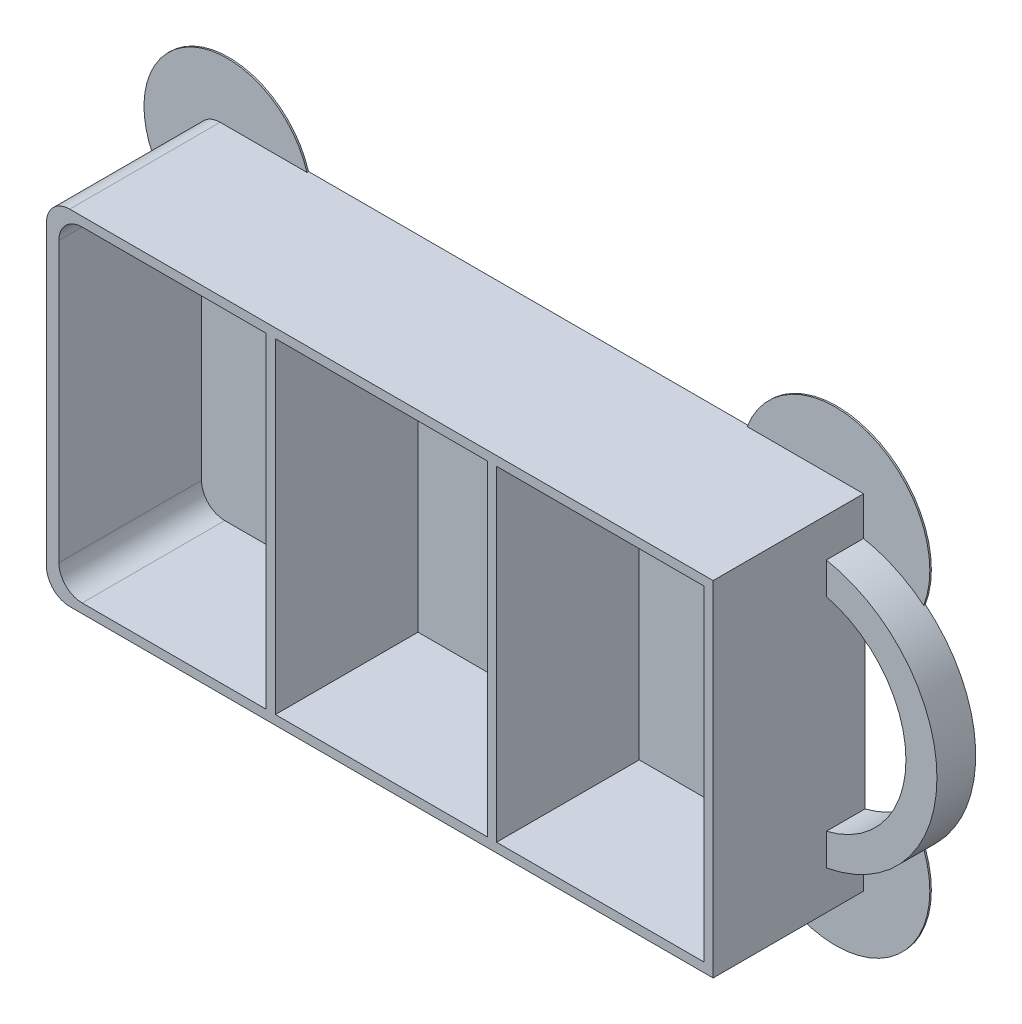
ISO-10303-21;
HEADER;
FILE_DESCRIPTION(('STEP AP214'),'2;1');
FILE_NAME('part.step','',(''),(''),'','','');
FILE_SCHEMA(('AUTOMOTIVE_DESIGN { 1 0 10303 214 1 1 1 1 }'));
ENDSEC;
DATA;
#1=APPLICATION_CONTEXT('core data for automotive mechanical design processes');
#2=APPLICATION_PROTOCOL_DEFINITION('international standard','automotive_design',2000,#1);
#3=PRODUCT_CONTEXT('',#1,'mechanical');
#4=PRODUCT('Part','Part','',(#3));
#5=PRODUCT_RELATED_PRODUCT_CATEGORY('part','',(#4));
#6=PRODUCT_DEFINITION_FORMATION('','',#4);
#7=PRODUCT_DEFINITION_CONTEXT('part definition',#1,'design');
#8=PRODUCT_DEFINITION('design','',#6,#7);
#9=PRODUCT_DEFINITION_SHAPE('','',#8);
#10=(LENGTH_UNIT() NAMED_UNIT(*) SI_UNIT(.MILLI.,.METRE.));
#11=(NAMED_UNIT(*) PLANE_ANGLE_UNIT() SI_UNIT($,.RADIAN.));
#12=(NAMED_UNIT(*) SI_UNIT($,.STERADIAN.) SOLID_ANGLE_UNIT());
#13=UNCERTAINTY_MEASURE_WITH_UNIT(LENGTH_MEASURE(1.E-05),#10,'distance_accuracy_value','');
#14=(GEOMETRIC_REPRESENTATION_CONTEXT(3) GLOBAL_UNCERTAINTY_ASSIGNED_CONTEXT((#13)) GLOBAL_UNIT_ASSIGNED_CONTEXT((#10,
#11,#12)) REPRESENTATION_CONTEXT('',''));
#15=CARTESIAN_POINT('',(0.,0.,0.));
#16=DIRECTION('',(0.,0.,1.));
#17=DIRECTION('',(1.,0.,0.));
#18=AXIS2_PLACEMENT_3D('',#15,#16,#17);
#19=CARTESIAN_POINT('',(-40.,-19.2,19.6));
#20=DIRECTION('',(0.,0.,-1.));
#21=DIRECTION('',(-1.,0.,0.));
#22=AXIS2_PLACEMENT_3D('',#19,#20,#21);
#23=CYLINDRICAL_SURFACE('',#22,3.);
#24=DIRECTION('',(0.,0.,-1.));
#25=VECTOR('',#24,1.);
#26=CARTESIAN_POINT('',(-43.,-19.2,19.6));
#27=LINE('',#26,#25);
#28=CARTESIAN_POINT('',(-43.,-19.2,0.199999999999999));
#29=VERTEX_POINT('',#28);
#30=CARTESIAN_POINT('',(-43.,-19.2,19.6));
#31=VERTEX_POINT('',#30);
#32=EDGE_CURVE('E289',#29,#31,#27,.F.);
#33=ORIENTED_EDGE('',*,*,#32,.F.);
#34=CARTESIAN_POINT('',(-40.,-19.2,0.199999999999999));
#35=DIRECTION('',(0.,0.,-1.));
#36=DIRECTION('',(-1.,0.,0.));
#37=AXIS2_PLACEMENT_3D('',#34,#35,#36);
#38=CIRCLE('',#37,3.);
#39=CARTESIAN_POINT('',(-40.,-22.2,0.199999999999999));
#40=VERTEX_POINT('',#39);
#41=EDGE_CURVE('E12',#29,#40,#38,.F.);
#42=ORIENTED_EDGE('',*,*,#41,.T.);
#43=DIRECTION('',(0.,0.,-1.));
#44=VECTOR('',#43,1.);
#45=CARTESIAN_POINT('',(-40.,-22.2,19.6));
#46=LINE('',#45,#44);
#47=CARTESIAN_POINT('',(-40.,-22.2,19.6));
#48=VERTEX_POINT('',#47);
#49=EDGE_CURVE('E300',#48,#40,#46,.T.);
#50=ORIENTED_EDGE('',*,*,#49,.F.);
#51=CARTESIAN_POINT('',(-40.,-19.2,19.6));
#52=DIRECTION('',(0.,0.,1.));
#53=DIRECTION('',(1.,0.,0.));
#54=AXIS2_PLACEMENT_3D('',#51,#52,#53);
#55=CIRCLE('',#54,3.);
#56=EDGE_CURVE('E296',#31,#48,#55,.T.);
#57=ORIENTED_EDGE('',*,*,#56,.F.);
#58=EDGE_LOOP('',(#33,#42,#50,#57));
#59=FACE_BOUND('',#58,.T.);
#60=ADVANCED_FACE('F41',(#59),#23,.T.);
#61=CARTESIAN_POINT('',(43.,22.2,19.6));
#62=DIRECTION('',(-1.,0.,0.));
#63=DIRECTION('',(0.,-1.,0.));
#64=AXIS2_PLACEMENT_3D('',#61,#62,#63);
#65=PLANE('',#64);
#66=DIRECTION('',(0.,0.,-1.));
#67=VECTOR('',#66,1.);
#68=CARTESIAN_POINT('',(43.,-22.2,19.6));
#69=LINE('',#68,#67);
#70=CARTESIAN_POINT('',(43.,-22.2,19.6));
#71=VERTEX_POINT('',#70);
#72=CARTESIAN_POINT('',(43.,-22.2,0.199999999999999));
#73=VERTEX_POINT('',#72);
#74=EDGE_CURVE('E283',#71,#73,#69,.T.);
#75=ORIENTED_EDGE('',*,*,#74,.T.);
#76=DIRECTION('',(0.,1.,0.));
#77=VECTOR('',#76,1.);
#78=CARTESIAN_POINT('',(43.,22.2,0.199999999999999));
#79=LINE('',#78,#77);
#80=CARTESIAN_POINT('',(43.,-17.2,0.2));
#81=VERTEX_POINT('',#80);
#82=EDGE_CURVE('E380',#73,#81,#79,.T.);
#83=ORIENTED_EDGE('',*,*,#82,.T.);
#84=DIRECTION('',(0.,0.,-1.));
#85=VECTOR('',#84,1.);
#86=CARTESIAN_POINT('',(43.,-17.2,5.));
#87=LINE('',#86,#85);
#88=CARTESIAN_POINT('',(43.,-17.2,5.));
#89=VERTEX_POINT('',#88);
#90=EDGE_CURVE('E490',#89,#81,#87,.T.);
#91=ORIENTED_EDGE('',*,*,#90,.F.);
#92=DIRECTION('',(0.,-1.,0.));
#93=VECTOR('',#92,1.);
#94=CARTESIAN_POINT('',(43.,-17.2,5.));
#95=LINE('',#94,#93);
#96=CARTESIAN_POINT('',(43.,-13.1087756865391,5.));
#97=VERTEX_POINT('',#96);
#98=EDGE_CURVE('E487',#97,#89,#95,.T.);
#99=ORIENTED_EDGE('',*,*,#98,.F.);
#100=DIRECTION('',(0.,0.,-1.));
#101=VECTOR('',#100,1.);
#102=CARTESIAN_POINT('',(43.,-13.1087756865391,5.));
#103=LINE('',#102,#101);
#104=CARTESIAN_POINT('',(43.,-13.1087756865391,0.));
#105=VERTEX_POINT('',#104);
#106=EDGE_CURVE('E496',#97,#105,#103,.T.);
#107=ORIENTED_EDGE('',*,*,#106,.T.);
#108=DIRECTION('',(0.,1.,0.));
#109=VECTOR('',#108,1.);
#110=CARTESIAN_POINT('',(43.,22.2,0.));
#111=LINE('',#110,#109);
#112=CARTESIAN_POINT('',(43.,13.1087756865391,0.));
#113=VERTEX_POINT('',#112);
#114=EDGE_CURVE('E361',#105,#113,#111,.T.);
#115=ORIENTED_EDGE('',*,*,#114,.T.);
#116=DIRECTION('',(0.,0.,-1.));
#117=VECTOR('',#116,1.);
#118=CARTESIAN_POINT('',(43.,13.1087756865391,5.));
#119=LINE('',#118,#117);
#120=CARTESIAN_POINT('',(43.,13.1087756865391,5.));
#121=VERTEX_POINT('',#120);
#122=EDGE_CURVE('E499',#121,#113,#119,.T.);
#123=ORIENTED_EDGE('',*,*,#122,.F.);
#124=DIRECTION('',(0.,-1.,0.));
#125=VECTOR('',#124,1.);
#126=CARTESIAN_POINT('',(43.,17.2,5.));
#127=LINE('',#126,#125);
#128=CARTESIAN_POINT('',(43.,17.2,5.));
#129=VERTEX_POINT('',#128);
#130=EDGE_CURVE('E480',#129,#121,#127,.T.);
#131=ORIENTED_EDGE('',*,*,#130,.F.);
#132=DIRECTION('',(0.,0.,-1.));
#133=VECTOR('',#132,1.);
#134=CARTESIAN_POINT('',(43.,17.2,5.));
#135=LINE('',#134,#133);
#136=CARTESIAN_POINT('',(43.,17.2,0.2));
#137=VERTEX_POINT('',#136);
#138=EDGE_CURVE('E362',#129,#137,#135,.T.);
#139=ORIENTED_EDGE('',*,*,#138,.T.);
#140=DIRECTION('',(0.,-1.,0.));
#141=VECTOR('',#140,1.);
#142=CARTESIAN_POINT('',(43.,22.2,0.199999999999999));
#143=LINE('',#142,#141);
#144=CARTESIAN_POINT('',(43.,22.2,0.199999999999999));
#145=VERTEX_POINT('',#144);
#146=EDGE_CURVE('E384',#145,#137,#143,.T.);
#147=ORIENTED_EDGE('',*,*,#146,.F.);
#148=DIRECTION('',(0.,0.,-1.));
#149=VECTOR('',#148,1.);
#150=CARTESIAN_POINT('',(43.,22.2,19.6));
#151=LINE('',#150,#149);
#152=CARTESIAN_POINT('',(43.,22.2,19.6));
#153=VERTEX_POINT('',#152);
#154=EDGE_CURVE('E285',#153,#145,#151,.T.);
#155=ORIENTED_EDGE('',*,*,#154,.F.);
#156=DIRECTION('',(0.,1.,0.));
#157=VECTOR('',#156,1.);
#158=CARTESIAN_POINT('',(43.,22.2,19.6));
#159=LINE('',#158,#157);
#160=EDGE_CURVE('E273',#71,#153,#159,.T.);
#161=ORIENTED_EDGE('',*,*,#160,.F.);
#162=EDGE_LOOP('',(#75,#83,#91,#99,#107,#115,#123,#131,#139,#147,#155,#161));
#163=FACE_BOUND('',#162,.T.);
#164=ADVANCED_FACE('F505',(#163),#65,.F.);
#165=CARTESIAN_POINT('',(0.,0.,19.6));
#166=DIRECTION('',(0.,0.,1.));
#167=DIRECTION('',(1.,0.,0.));
#168=AXIS2_PLACEMENT_3D('',#165,#166,#167);
#169=PLANE('',#168);
#170=DIRECTION('',(-1.,0.,0.));
#171=VECTOR('',#170,1.);
#172=CARTESIAN_POINT('',(0.,21.,19.6));
#173=LINE('',#172,#171);
#174=CARTESIAN_POINT('',(-14.6666666666667,21.,19.6));
#175=VERTEX_POINT('',#174);
#176=CARTESIAN_POINT('',(-38.4,21.,19.6));
#177=VERTEX_POINT('',#176);
#178=EDGE_CURVE('E401',#175,#177,#173,.T.);
#179=ORIENTED_EDGE('',*,*,#178,.F.);
#180=DIRECTION('',(0.,1.,0.));
#181=VECTOR('',#180,1.);
#182=CARTESIAN_POINT('',(-14.6666666666667,0.,19.6));
#183=LINE('',#182,#181);
#184=CARTESIAN_POINT('',(-14.6666666666667,-21.,19.6));
#185=VERTEX_POINT('',#184);
#186=EDGE_CURVE('E410',#185,#175,#183,.T.);
#187=ORIENTED_EDGE('',*,*,#186,.F.);
#188=DIRECTION('',(1.,0.,0.));
#189=VECTOR('',#188,1.);
#190=CARTESIAN_POINT('',(0.,-21.,19.6));
#191=LINE('',#190,#189);
#192=CARTESIAN_POINT('',(-38.4,-21.,19.6));
#193=VERTEX_POINT('',#192);
#194=EDGE_CURVE('E408',#193,#185,#191,.T.);
#195=ORIENTED_EDGE('',*,*,#194,.F.);
#196=CARTESIAN_POINT('',(-38.4,-18.,19.6));
#197=DIRECTION('',(0.,0.,1.));
#198=DIRECTION('',(1.,0.,0.));
#199=AXIS2_PLACEMENT_3D('',#196,#197,#198);
#200=CIRCLE('',#199,3.);
#201=CARTESIAN_POINT('',(-41.4,-18.,19.6));
#202=VERTEX_POINT('',#201);
#203=EDGE_CURVE('E316',#193,#202,#200,.F.);
#204=ORIENTED_EDGE('',*,*,#203,.T.);
#205=DIRECTION('',(0.,-1.,0.));
#206=VECTOR('',#205,1.);
#207=CARTESIAN_POINT('',(-41.4,0.,19.6));
#208=LINE('',#207,#206);
#209=CARTESIAN_POINT('',(-41.4,18.,19.6));
#210=VERTEX_POINT('',#209);
#211=EDGE_CURVE('E404',#210,#202,#208,.T.);
#212=ORIENTED_EDGE('',*,*,#211,.F.);
#213=CARTESIAN_POINT('',(-38.4,18.,19.6));
#214=DIRECTION('',(0.,0.,1.));
#215=DIRECTION('',(1.,0.,0.));
#216=AXIS2_PLACEMENT_3D('',#213,#214,#215);
#217=CIRCLE('',#216,3.);
#218=EDGE_CURVE('E318',#210,#177,#217,.F.);
#219=ORIENTED_EDGE('',*,*,#218,.T.);
#220=EDGE_LOOP('',(#179,#187,#195,#204,#212,#219));
#221=FACE_BOUND('',#220,.T.);
#222=DIRECTION('',(-1.,0.,0.));
#223=VECTOR('',#222,1.);
#224=CARTESIAN_POINT('',(0.,21.,19.6));
#225=LINE('',#224,#223);
#226=CARTESIAN_POINT('',(41.8,21.,19.6));
#227=VERTEX_POINT('',#226);
#228=CARTESIAN_POINT('',(15.0666666666667,21.,19.6));
#229=VERTEX_POINT('',#228);
#230=EDGE_CURVE('E391',#227,#229,#225,.T.);
#231=ORIENTED_EDGE('',*,*,#230,.F.);
#232=DIRECTION('',(0.,1.,0.));
#233=VECTOR('',#232,1.);
#234=CARTESIAN_POINT('',(41.8,0.,19.6));
#235=LINE('',#234,#233);
#236=CARTESIAN_POINT('',(41.8,-21.,19.6));
#237=VERTEX_POINT('',#236);
#238=EDGE_CURVE('E465',#237,#227,#235,.T.);
#239=ORIENTED_EDGE('',*,*,#238,.F.);
#240=DIRECTION('',(1.,0.,0.));
#241=VECTOR('',#240,1.);
#242=CARTESIAN_POINT('',(0.,-21.,19.6));
#243=LINE('',#242,#241);
#244=CARTESIAN_POINT('',(15.0666666666667,-21.,19.6));
#245=VERTEX_POINT('',#244);
#246=EDGE_CURVE('E462',#245,#237,#243,.T.);
#247=ORIENTED_EDGE('',*,*,#246,.F.);
#248=DIRECTION('',(0.,-1.,0.));
#249=VECTOR('',#248,1.);
#250=CARTESIAN_POINT('',(15.0666666666667,0.,19.6));
#251=LINE('',#250,#249);
#252=EDGE_CURVE('E459',#229,#245,#251,.T.);
#253=ORIENTED_EDGE('',*,*,#252,.F.);
#254=EDGE_LOOP('',(#231,#239,#247,#253));
#255=FACE_BOUND('',#254,.T.);
#256=DIRECTION('',(-1.,0.,0.));
#257=VECTOR('',#256,1.);
#258=CARTESIAN_POINT('',(-43.,22.2,19.6));
#259=LINE('',#258,#257);
#260=CARTESIAN_POINT('',(-40.,22.2,19.6));
#261=VERTEX_POINT('',#260);
#262=EDGE_CURVE('E277',#153,#261,#259,.T.);
#263=ORIENTED_EDGE('',*,*,#262,.T.);
#264=CARTESIAN_POINT('',(-40.,19.2,19.6));
#265=DIRECTION('',(0.,0.,1.));
#266=DIRECTION('',(1.,0.,0.));
#267=AXIS2_PLACEMENT_3D('',#264,#265,#266);
#268=CIRCLE('',#267,3.);
#269=CARTESIAN_POINT('',(-43.,19.2,19.6));
#270=VERTEX_POINT('',#269);
#271=EDGE_CURVE('E298',#261,#270,#268,.T.);
#272=ORIENTED_EDGE('',*,*,#271,.T.);
#273=DIRECTION('',(0.,-1.,0.));
#274=VECTOR('',#273,1.);
#275=CARTESIAN_POINT('',(-43.,22.2,19.6));
#276=LINE('',#275,#274);
#277=EDGE_CURVE('E351',#270,#31,#276,.T.);
#278=ORIENTED_EDGE('',*,*,#277,.T.);
#279=ORIENTED_EDGE('',*,*,#56,.T.);
#280=DIRECTION('',(1.,0.,0.));
#281=VECTOR('',#280,1.);
#282=CARTESIAN_POINT('',(-43.,-22.2,19.6));
#283=LINE('',#282,#281);
#284=EDGE_CURVE('E286',#48,#71,#283,.T.);
#285=ORIENTED_EDGE('',*,*,#284,.T.);
#286=ORIENTED_EDGE('',*,*,#160,.T.);
#287=EDGE_LOOP('',(#263,#272,#278,#279,#285,#286));
#288=FACE_BOUND('',#287,.T.);
#289=DIRECTION('',(-1.,0.,0.));
#290=VECTOR('',#289,1.);
#291=CARTESIAN_POINT('',(0.,21.,19.6));
#292=LINE('',#291,#290);
#293=CARTESIAN_POINT('',(13.8666666666667,21.,19.6));
#294=VERTEX_POINT('',#293);
#295=CARTESIAN_POINT('',(-13.4666666666667,21.,19.6));
#296=VERTEX_POINT('',#295);
#297=EDGE_CURVE('E432',#294,#296,#292,.T.);
#298=ORIENTED_EDGE('',*,*,#297,.F.);
#299=DIRECTION('',(0.,-1.,0.));
#300=VECTOR('',#299,1.);
#301=CARTESIAN_POINT('',(13.8666666666667,0.,19.6));
#302=LINE('',#301,#300);
#303=CARTESIAN_POINT('',(13.8666666666667,-21.,19.6));
#304=VERTEX_POINT('',#303);
#305=EDGE_CURVE('E429',#294,#304,#302,.T.);
#306=ORIENTED_EDGE('',*,*,#305,.T.);
#307=DIRECTION('',(1.,0.,0.));
#308=VECTOR('',#307,1.);
#309=CARTESIAN_POINT('',(0.,-21.,19.6));
#310=LINE('',#309,#308);
#311=CARTESIAN_POINT('',(-13.4666666666667,-21.,19.6));
#312=VERTEX_POINT('',#311);
#313=EDGE_CURVE('E439',#312,#304,#310,.T.);
#314=ORIENTED_EDGE('',*,*,#313,.F.);
#315=DIRECTION('',(0.,1.,0.));
#316=VECTOR('',#315,1.);
#317=CARTESIAN_POINT('',(-13.4666666666667,0.,19.6));
#318=LINE('',#317,#316);
#319=EDGE_CURVE('E436',#312,#296,#318,.T.);
#320=ORIENTED_EDGE('',*,*,#319,.T.);
#321=EDGE_LOOP('',(#298,#306,#314,#320));
#322=FACE_BOUND('',#321,.T.);
#323=ADVANCED_FACE('F349',(#221,#255,#288,#322),#169,.T.);
#324=CARTESIAN_POINT('',(-43.,22.2,19.6));
#325=DIRECTION('',(0.,-1.,0.));
#326=DIRECTION('',(0.,0.,-1.));
#327=AXIS2_PLACEMENT_3D('',#324,#325,#326);
#328=PLANE('',#327);
#329=DIRECTION('',(-1.,0.,0.));
#330=VECTOR('',#329,1.);
#331=CARTESIAN_POINT('',(-43.,22.2,0.));
#332=LINE('',#331,#330);
#333=CARTESIAN_POINT('',(27.9898071749444,22.2,0.));
#334=VERTEX_POINT('',#333);
#335=CARTESIAN_POINT('',(-28.7935026442278,22.2,0.));
#336=VERTEX_POINT('',#335);
#337=EDGE_CURVE('E279',#334,#336,#332,.T.);
#338=ORIENTED_EDGE('',*,*,#337,.T.);
#339=DIRECTION('',(0.,0.,-1.));
#340=VECTOR('',#339,1.);
#341=CARTESIAN_POINT('',(-28.7935026442278,22.2,0.2));
#342=LINE('',#341,#340);
#343=CARTESIAN_POINT('',(-28.7935026442278,22.2,0.2));
#344=VERTEX_POINT('',#343);
#345=EDGE_CURVE('E341',#344,#336,#342,.T.);
#346=ORIENTED_EDGE('',*,*,#345,.F.);
#347=DIRECTION('',(-1.,0.,0.));
#348=VECTOR('',#347,1.);
#349=CARTESIAN_POINT('',(-43.,22.2,0.199999999999999));
#350=LINE('',#349,#348);
#351=CARTESIAN_POINT('',(-40.,22.2,0.199999999999999));
#352=VERTEX_POINT('',#351);
#353=EDGE_CURVE('E329',#344,#352,#350,.T.);
#354=ORIENTED_EDGE('',*,*,#353,.T.);
#355=DIRECTION('',(0.,0.,-1.));
#356=VECTOR('',#355,1.);
#357=CARTESIAN_POINT('',(-40.,22.2,19.6));
#358=LINE('',#357,#356);
#359=EDGE_CURVE('E294',#352,#261,#358,.F.);
#360=ORIENTED_EDGE('',*,*,#359,.T.);
#361=ORIENTED_EDGE('',*,*,#262,.F.);
#362=ORIENTED_EDGE('',*,*,#154,.T.);
#363=DIRECTION('',(1.,0.,0.));
#364=VECTOR('',#363,1.);
#365=CARTESIAN_POINT('',(-43.,22.2,0.199999999999999));
#366=LINE('',#365,#364);
#367=CARTESIAN_POINT('',(27.9898071749445,22.2,0.199999999999999));
#368=VERTEX_POINT('',#367);
#369=EDGE_CURVE('E388',#368,#145,#366,.T.);
#370=ORIENTED_EDGE('',*,*,#369,.F.);
#371=DIRECTION('',(0.,0.,-1.));
#372=VECTOR('',#371,1.);
#373=CARTESIAN_POINT('',(27.9898071749445,22.2,0.2));
#374=LINE('',#373,#372);
#375=EDGE_CURVE('E365',#368,#334,#374,.T.);
#376=ORIENTED_EDGE('',*,*,#375,.T.);
#377=EDGE_LOOP('',(#338,#346,#354,#360,#361,#362,#370,#376));
#378=FACE_BOUND('',#377,.T.);
#379=ADVANCED_FACE('F339',(#378),#328,.F.);
#380=CARTESIAN_POINT('',(-43.,22.2,19.6));
#381=DIRECTION('',(1.,0.,0.));
#382=DIRECTION('',(0.,1.,0.));
#383=AXIS2_PLACEMENT_3D('',#380,#381,#382);
#384=PLANE('',#383);
#385=DIRECTION('',(0.,-1.,0.));
#386=VECTOR('',#385,1.);
#387=CARTESIAN_POINT('',(-43.,22.2,0.));
#388=LINE('',#387,#386);
#389=CARTESIAN_POINT('',(-43.,9.06873174434304,0.));
#390=VERTEX_POINT('',#389);
#391=CARTESIAN_POINT('',(-43.,-9.06873174434304,0.));
#392=VERTEX_POINT('',#391);
#393=EDGE_CURVE('E274',#390,#392,#388,.T.);
#394=ORIENTED_EDGE('',*,*,#393,.T.);
#395=DIRECTION('',(0.,0.,-1.));
#396=VECTOR('',#395,1.);
#397=CARTESIAN_POINT('',(-43.,-9.06873174434304,0.2));
#398=LINE('',#397,#396);
#399=CARTESIAN_POINT('',(-43.,-9.06873174434304,0.2));
#400=VERTEX_POINT('',#399);
#401=EDGE_CURVE('E255',#400,#392,#398,.T.);
#402=ORIENTED_EDGE('',*,*,#401,.F.);
#403=DIRECTION('',(0.,1.,0.));
#404=VECTOR('',#403,1.);
#405=CARTESIAN_POINT('',(-43.,22.2,0.199999999999999));
#406=LINE('',#405,#404);
#407=EDGE_CURVE('E518',#29,#400,#406,.T.);
#408=ORIENTED_EDGE('',*,*,#407,.F.);
#409=ORIENTED_EDGE('',*,*,#32,.T.);
#410=ORIENTED_EDGE('',*,*,#277,.F.);
#411=DIRECTION('',(0.,0.,-1.));
#412=VECTOR('',#411,1.);
#413=CARTESIAN_POINT('',(-43.,19.2,19.6));
#414=LINE('',#413,#412);
#415=CARTESIAN_POINT('',(-43.,19.2,0.199999999999999));
#416=VERTEX_POINT('',#415);
#417=EDGE_CURVE('E291',#270,#416,#414,.T.);
#418=ORIENTED_EDGE('',*,*,#417,.T.);
#419=DIRECTION('',(0.,-1.,0.));
#420=VECTOR('',#419,1.);
#421=CARTESIAN_POINT('',(-43.,22.2,0.199999999999999));
#422=LINE('',#421,#420);
#423=CARTESIAN_POINT('',(-43.,9.06873174434304,0.2));
#424=VERTEX_POINT('',#423);
#425=EDGE_CURVE('E332',#416,#424,#422,.T.);
#426=ORIENTED_EDGE('',*,*,#425,.T.);
#427=DIRECTION('',(0.,0.,-1.));
#428=VECTOR('',#427,1.);
#429=CARTESIAN_POINT('',(-43.,9.06873174434304,0.2));
#430=LINE('',#429,#428);
#431=EDGE_CURVE('E519',#424,#390,#430,.T.);
#432=ORIENTED_EDGE('',*,*,#431,.T.);
#433=EDGE_LOOP('',(#394,#402,#408,#409,#410,#418,#426,#432));
#434=FACE_BOUND('',#433,.T.);
#435=ADVANCED_FACE('F354',(#434),#384,.F.);
#436=CARTESIAN_POINT('',(-43.,-22.2,19.6));
#437=DIRECTION('',(0.,1.,0.));
#438=DIRECTION('',(0.,0.,1.));
#439=AXIS2_PLACEMENT_3D('',#436,#437,#438);
#440=PLANE('',#439);
#441=DIRECTION('',(-1.,0.,0.));
#442=VECTOR('',#441,1.);
#443=CARTESIAN_POINT('',(-43.,-22.2,0.199999999999999));
#444=LINE('',#443,#442);
#445=CARTESIAN_POINT('',(-28.7935026442278,-22.2,0.2));
#446=VERTEX_POINT('',#445);
#447=EDGE_CURVE('E260',#446,#40,#444,.T.);
#448=ORIENTED_EDGE('',*,*,#447,.F.);
#449=DIRECTION('',(0.,0.,-1.));
#450=VECTOR('',#449,1.);
#451=CARTESIAN_POINT('',(-28.7935026442278,-22.2,0.2));
#452=LINE('',#451,#450);
#453=CARTESIAN_POINT('',(-28.7935026442278,-22.2,0.));
#454=VERTEX_POINT('',#453);
#455=EDGE_CURVE('E252',#446,#454,#452,.T.);
#456=ORIENTED_EDGE('',*,*,#455,.T.);
#457=DIRECTION('',(1.,0.,0.));
#458=VECTOR('',#457,1.);
#459=CARTESIAN_POINT('',(-43.,-22.2,0.));
#460=LINE('',#459,#458);
#461=CARTESIAN_POINT('',(27.9898071749444,-22.2,0.));
#462=VERTEX_POINT('',#461);
#463=EDGE_CURVE('E265',#454,#462,#460,.T.);
#464=ORIENTED_EDGE('',*,*,#463,.T.);
#465=DIRECTION('',(0.,0.,-1.));
#466=VECTOR('',#465,1.);
#467=CARTESIAN_POINT('',(27.9898071749445,-22.2,0.2));
#468=LINE('',#467,#466);
#469=CARTESIAN_POINT('',(27.9898071749445,-22.2,0.199999999999999));
#470=VERTEX_POINT('',#469);
#471=EDGE_CURVE('E56',#470,#462,#468,.T.);
#472=ORIENTED_EDGE('',*,*,#471,.F.);
#473=DIRECTION('',(1.,0.,0.));
#474=VECTOR('',#473,1.);
#475=CARTESIAN_POINT('',(-43.,-22.2,0.199999999999999));
#476=LINE('',#475,#474);
#477=EDGE_CURVE('E60',#470,#73,#476,.T.);
#478=ORIENTED_EDGE('',*,*,#477,.T.);
#479=ORIENTED_EDGE('',*,*,#74,.F.);
#480=ORIENTED_EDGE('',*,*,#284,.F.);
#481=ORIENTED_EDGE('',*,*,#49,.T.);
#482=EDGE_LOOP('',(#448,#456,#464,#472,#478,#479,#480,#481));
#483=FACE_BOUND('',#482,.T.);
#484=ADVANCED_FACE('F264',(#483),#440,.F.);
#485=CARTESIAN_POINT('',(0.,0.,0.));
#486=DIRECTION('',(0.,0.,1.));
#487=DIRECTION('',(1.,0.,0.));
#488=AXIS2_PLACEMENT_3D('',#485,#486,#487);
#489=PLANE('',#488);
#490=CARTESIAN_POINT('',(-39.0748386955667,-19.0726849277525,0.));
#491=DIRECTION('',(0.,0.,-1.));
#492=DIRECTION('',(-1.,0.,0.));
#493=AXIS2_PLACEMENT_3D('',#490,#491,#492);
#494=CIRCLE('',#493,10.7464399017381);
#495=EDGE_CURVE('E248',#454,#392,#494,.T.);
#496=ORIENTED_EDGE('',*,*,#495,.T.);
#497=ORIENTED_EDGE('',*,*,#393,.F.);
#498=CARTESIAN_POINT('',(-39.0748386955667,19.0726849277525,0.));
#499=DIRECTION('',(0.,0.,-1.));
#500=DIRECTION('',(1.,0.,0.));
#501=AXIS2_PLACEMENT_3D('',#498,#499,#500);
#502=CIRCLE('',#501,10.7464399017381);
#503=EDGE_CURVE('E370',#390,#336,#502,.T.);
#504=ORIENTED_EDGE('',*,*,#503,.T.);
#505=ORIENTED_EDGE('',*,*,#337,.F.);
#506=CARTESIAN_POINT('',(39.3809279660677,17.9059340937888,0.));
#507=DIRECTION('',(0.,0.,-1.));
#508=DIRECTION('',(-1.,0.,0.));
#509=AXIS2_PLACEMENT_3D('',#506,#507,#508);
#510=CIRCLE('',#509,12.173604022016);
#511=CARTESIAN_POINT('',(50.7720487571908,13.6118681875776,0.));
#512=VERTEX_POINT('',#511);
#513=EDGE_CURVE('E369',#334,#512,#510,.T.);
#514=ORIENTED_EDGE('',*,*,#513,.T.);
#515=CARTESIAN_POINT('',(39.7735468390197,0.,0.));
#516=DIRECTION('',(0.,0.,1.));
#517=DIRECTION('',(1.,0.,0.));
#518=AXIS2_PLACEMENT_3D('',#515,#516,#517);
#519=CIRCLE('',#518,17.5);
#520=CARTESIAN_POINT('',(50.7720487571908,-13.6118681875775,0.));
#521=VERTEX_POINT('',#520);
#522=EDGE_CURVE('E419',#521,#512,#519,.T.);
#523=ORIENTED_EDGE('',*,*,#522,.F.);
#524=CARTESIAN_POINT('',(39.3809279660677,-17.9059340937888,0.));
#525=DIRECTION('',(0.,0.,-1.));
#526=DIRECTION('',(1.,0.,0.));
#527=AXIS2_PLACEMENT_3D('',#524,#525,#526);
#528=CIRCLE('',#527,12.173604022016);
#529=EDGE_CURVE('E272',#521,#462,#528,.T.);
#530=ORIENTED_EDGE('',*,*,#529,.T.);
#531=ORIENTED_EDGE('',*,*,#463,.F.);
#532=EDGE_LOOP('',(#496,#497,#504,#505,#514,#523,#530,#531));
#533=FACE_BOUND('',#532,.T.);
#534=CARTESIAN_POINT('',(39.7735468390197,0.,0.));
#535=DIRECTION('',(0.,0.,-1.));
#536=DIRECTION('',(1.,0.,0.));
#537=AXIS2_PLACEMENT_3D('',#534,#535,#536);
#538=CIRCLE('',#537,13.5);
#539=EDGE_CURVE('E481',#113,#105,#538,.T.);
#540=ORIENTED_EDGE('',*,*,#539,.F.);
#541=ORIENTED_EDGE('',*,*,#114,.F.);
#542=EDGE_LOOP('',(#540,#541));
#543=FACE_BOUND('',#542,.T.);
#544=ADVANCED_FACE('F269',(#533,#543),#489,.F.);
#545=CARTESIAN_POINT('',(39.7735468390197,0.,5.));
#546=DIRECTION('',(0.,0.,-1.));
#547=DIRECTION('',(-1.,0.,0.));
#548=AXIS2_PLACEMENT_3D('',#545,#546,#547);
#549=CYLINDRICAL_SURFACE('',#548,17.5);
#550=CARTESIAN_POINT('',(39.7735468390197,0.,0.2));
#551=DIRECTION('',(0.,0.,1.));
#552=DIRECTION('',(1.,0.,0.));
#553=AXIS2_PLACEMENT_3D('',#550,#551,#552);
#554=CIRCLE('',#553,17.5);
#555=CARTESIAN_POINT('',(50.7720487571908,-13.6118681875776,0.2));
#556=VERTEX_POINT('',#555);
#557=EDGE_CURVE('E323',#81,#556,#554,.T.);
#558=ORIENTED_EDGE('',*,*,#557,.T.);
#559=DIRECTION('',(0.,0.,-1.));
#560=VECTOR('',#559,1.);
#561=CARTESIAN_POINT('',(50.7720487571908,-13.6118681875775,0.2));
#562=LINE('',#561,#560);
#563=EDGE_CURVE('E342',#556,#521,#562,.T.);
#564=ORIENTED_EDGE('',*,*,#563,.T.);
#565=ORIENTED_EDGE('',*,*,#522,.T.);
#566=DIRECTION('',(0.,0.,-1.));
#567=VECTOR('',#566,1.);
#568=CARTESIAN_POINT('',(50.7720487571908,13.6118681875775,0.2));
#569=LINE('',#568,#567);
#570=CARTESIAN_POINT('',(50.7720487571908,13.6118681875776,0.2));
#571=VERTEX_POINT('',#570);
#572=EDGE_CURVE('E376',#571,#512,#569,.T.);
#573=ORIENTED_EDGE('',*,*,#572,.F.);
#574=CARTESIAN_POINT('',(39.7735468390197,0.,0.2));
#575=DIRECTION('',(0.,0.,-1.));
#576=DIRECTION('',(-1.,0.,0.));
#577=AXIS2_PLACEMENT_3D('',#574,#575,#576);
#578=CIRCLE('',#577,17.5);
#579=EDGE_CURVE('E320',#137,#571,#578,.T.);
#580=ORIENTED_EDGE('',*,*,#579,.F.);
#581=ORIENTED_EDGE('',*,*,#138,.F.);
#582=CARTESIAN_POINT('',(39.7735468390197,0.,5.));
#583=DIRECTION('',(0.,0.,1.));
#584=DIRECTION('',(1.,0.,0.));
#585=AXIS2_PLACEMENT_3D('',#582,#583,#584);
#586=CIRCLE('',#585,17.5);
#587=EDGE_CURVE('E477',#89,#129,#586,.T.);
#588=ORIENTED_EDGE('',*,*,#587,.F.);
#589=ORIENTED_EDGE('',*,*,#90,.T.);
#590=EDGE_LOOP('',(#558,#564,#565,#573,#580,#581,#588,#589));
#591=FACE_BOUND('',#590,.T.);
#592=ADVANCED_FACE('F540',(#591),#549,.T.);
#593=CARTESIAN_POINT('',(39.7735468390197,0.,5.));
#594=DIRECTION('',(0.,0.,-1.));
#595=DIRECTION('',(-1.,0.,0.));
#596=AXIS2_PLACEMENT_3D('',#593,#594,#595);
#597=CYLINDRICAL_SURFACE('',#596,13.5);
#598=ORIENTED_EDGE('',*,*,#539,.T.);
#599=ORIENTED_EDGE('',*,*,#106,.F.);
#600=CARTESIAN_POINT('',(39.7735468390197,0.,5.));
#601=DIRECTION('',(0.,0.,-1.));
#602=DIRECTION('',(1.,0.,0.));
#603=AXIS2_PLACEMENT_3D('',#600,#601,#602);
#604=CIRCLE('',#603,13.5);
#605=EDGE_CURVE('E484',#121,#97,#604,.T.);
#606=ORIENTED_EDGE('',*,*,#605,.F.);
#607=ORIENTED_EDGE('',*,*,#122,.T.);
#608=EDGE_LOOP('',(#598,#599,#606,#607));
#609=FACE_BOUND('',#608,.T.);
#610=ADVANCED_FACE('F655',(#609),#597,.F.);
#611=CARTESIAN_POINT('',(39.7735468390197,0.,5.));
#612=DIRECTION('',(0.,0.,1.));
#613=DIRECTION('',(1.,0.,0.));
#614=AXIS2_PLACEMENT_3D('',#611,#612,#613);
#615=PLANE('',#614);
#616=ORIENTED_EDGE('',*,*,#587,.T.);
#617=ORIENTED_EDGE('',*,*,#130,.T.);
#618=ORIENTED_EDGE('',*,*,#605,.T.);
#619=ORIENTED_EDGE('',*,*,#98,.T.);
#620=EDGE_LOOP('',(#616,#617,#618,#619));
#621=FACE_BOUND('',#620,.T.);
#622=ADVANCED_FACE('F651',(#621),#615,.T.);
#623=CARTESIAN_POINT('',(0.,21.,-50.1109879279097));
#624=DIRECTION('',(0.,1.,0.));
#625=DIRECTION('',(0.,0.,1.));
#626=AXIS2_PLACEMENT_3D('',#623,#624,#625);
#627=PLANE('',#626);
#628=DIRECTION('',(1.,0.,0.));
#629=VECTOR('',#628,1.);
#630=CARTESIAN_POINT('',(0.,21.,1.2));
#631=LINE('',#630,#629);
#632=CARTESIAN_POINT('',(15.0666666666667,21.,1.2));
#633=VERTEX_POINT('',#632);
#634=CARTESIAN_POINT('',(41.8,21.,1.2));
#635=VERTEX_POINT('',#634);
#636=EDGE_CURVE('E456',#633,#635,#631,.T.);
#637=ORIENTED_EDGE('',*,*,#636,.T.);
#638=DIRECTION('',(0.,0.,1.));
#639=VECTOR('',#638,1.);
#640=CARTESIAN_POINT('',(41.8,21.,-50.1109879279097));
#641=LINE('',#640,#639);
#642=EDGE_CURVE('E454',#635,#227,#641,.T.);
#643=ORIENTED_EDGE('',*,*,#642,.T.);
#644=ORIENTED_EDGE('',*,*,#230,.T.);
#645=DIRECTION('',(0.,0.,1.));
#646=VECTOR('',#645,1.);
#647=CARTESIAN_POINT('',(15.0666666666667,21.,-50.1109879279097));
#648=LINE('',#647,#646);
#649=EDGE_CURVE('E468',#633,#229,#648,.T.);
#650=ORIENTED_EDGE('',*,*,#649,.F.);
#651=EDGE_LOOP('',(#637,#643,#644,#650));
#652=FACE_BOUND('',#651,.T.);
#653=ADVANCED_FACE('F641',(#652),#627,.F.);
#654=CARTESIAN_POINT('',(41.8,0.,-50.1109879279097));
#655=DIRECTION('',(1.,0.,0.));
#656=DIRECTION('',(0.,1.,0.));
#657=AXIS2_PLACEMENT_3D('',#654,#655,#656);
#658=PLANE('',#657);
#659=DIRECTION('',(0.,-1.,0.));
#660=VECTOR('',#659,1.);
#661=CARTESIAN_POINT('',(41.8,0.,1.2));
#662=LINE('',#661,#660);
#663=CARTESIAN_POINT('',(41.8,-21.,1.2));
#664=VERTEX_POINT('',#663);
#665=EDGE_CURVE('E453',#635,#664,#662,.T.);
#666=ORIENTED_EDGE('',*,*,#665,.T.);
#667=DIRECTION('',(0.,0.,1.));
#668=VECTOR('',#667,1.);
#669=CARTESIAN_POINT('',(41.8,-21.,-50.1109879279097));
#670=LINE('',#669,#668);
#671=EDGE_CURVE('E470',#664,#237,#670,.T.);
#672=ORIENTED_EDGE('',*,*,#671,.T.);
#673=ORIENTED_EDGE('',*,*,#238,.T.);
#674=ORIENTED_EDGE('',*,*,#642,.F.);
#675=EDGE_LOOP('',(#666,#672,#673,#674));
#676=FACE_BOUND('',#675,.T.);
#677=ADVANCED_FACE('F637',(#676),#658,.F.);
#678=CARTESIAN_POINT('',(0.,-21.,-50.1109879279097));
#679=DIRECTION('',(0.,-1.,0.));
#680=DIRECTION('',(0.,0.,-1.));
#681=AXIS2_PLACEMENT_3D('',#678,#679,#680);
#682=PLANE('',#681);
#683=DIRECTION('',(-1.,0.,0.));
#684=VECTOR('',#683,1.);
#685=CARTESIAN_POINT('',(0.,-21.,1.2));
#686=LINE('',#685,#684);
#687=CARTESIAN_POINT('',(15.0666666666667,-21.,1.2));
#688=VERTEX_POINT('',#687);
#689=EDGE_CURVE('E451',#664,#688,#686,.T.);
#690=ORIENTED_EDGE('',*,*,#689,.T.);
#691=DIRECTION('',(0.,0.,1.));
#692=VECTOR('',#691,1.);
#693=CARTESIAN_POINT('',(15.0666666666667,-21.,-50.1109879279097));
#694=LINE('',#693,#692);
#695=EDGE_CURVE('E472',#688,#245,#694,.T.);
#696=ORIENTED_EDGE('',*,*,#695,.T.);
#697=ORIENTED_EDGE('',*,*,#246,.T.);
#698=ORIENTED_EDGE('',*,*,#671,.F.);
#699=EDGE_LOOP('',(#690,#696,#697,#698));
#700=FACE_BOUND('',#699,.T.);
#701=ADVANCED_FACE('F640',(#700),#682,.F.);
#702=CARTESIAN_POINT('',(15.0666666666667,0.,-50.1109879279097));
#703=DIRECTION('',(-1.,0.,0.));
#704=DIRECTION('',(0.,0.,1.));
#705=AXIS2_PLACEMENT_3D('',#702,#703,#704);
#706=PLANE('',#705);
#707=DIRECTION('',(0.,1.,0.));
#708=VECTOR('',#707,1.);
#709=CARTESIAN_POINT('',(15.0666666666667,0.,1.2));
#710=LINE('',#709,#708);
#711=EDGE_CURVE('E433',#688,#633,#710,.T.);
#712=ORIENTED_EDGE('',*,*,#711,.T.);
#713=ORIENTED_EDGE('',*,*,#649,.T.);
#714=ORIENTED_EDGE('',*,*,#252,.T.);
#715=ORIENTED_EDGE('',*,*,#695,.F.);
#716=EDGE_LOOP('',(#712,#713,#714,#715));
#717=FACE_BOUND('',#716,.T.);
#718=ADVANCED_FACE('F635',(#717),#706,.F.);
#719=CARTESIAN_POINT('',(0.,0.,1.2));
#720=DIRECTION('',(0.,0.,1.));
#721=DIRECTION('',(1.,0.,0.));
#722=AXIS2_PLACEMENT_3D('',#719,#720,#721);
#723=PLANE('',#722);
#724=ORIENTED_EDGE('',*,*,#636,.F.);
#725=ORIENTED_EDGE('',*,*,#711,.F.);
#726=ORIENTED_EDGE('',*,*,#689,.F.);
#727=ORIENTED_EDGE('',*,*,#665,.F.);
#728=EDGE_LOOP('',(#724,#725,#726,#727));
#729=FACE_BOUND('',#728,.T.);
#730=ADVANCED_FACE('F631',(#729),#723,.T.);
#731=CARTESIAN_POINT('',(13.8666666666667,0.,-50.1109879279097));
#732=DIRECTION('',(-1.,0.,0.));
#733=DIRECTION('',(0.,0.,1.));
#734=AXIS2_PLACEMENT_3D('',#731,#732,#733);
#735=PLANE('',#734);
#736=DIRECTION('',(0.,0.,1.));
#737=VECTOR('',#736,1.);
#738=CARTESIAN_POINT('',(13.8666666666667,-21.,-50.1109879279097));
#739=LINE('',#738,#737);
#740=CARTESIAN_POINT('',(13.8666666666667,-21.,1.2));
#741=VERTEX_POINT('',#740);
#742=EDGE_CURVE('E424',#741,#304,#739,.T.);
#743=ORIENTED_EDGE('',*,*,#742,.T.);
#744=ORIENTED_EDGE('',*,*,#305,.F.);
#745=DIRECTION('',(0.,0.,1.));
#746=VECTOR('',#745,1.);
#747=CARTESIAN_POINT('',(13.8666666666667,21.,-50.1109879279097));
#748=LINE('',#747,#746);
#749=CARTESIAN_POINT('',(13.8666666666667,21.,1.2));
#750=VERTEX_POINT('',#749);
#751=EDGE_CURVE('E442',#750,#294,#748,.T.);
#752=ORIENTED_EDGE('',*,*,#751,.F.);
#753=DIRECTION('',(0.,1.,0.));
#754=VECTOR('',#753,1.);
#755=CARTESIAN_POINT('',(13.8666666666667,0.,1.2));
#756=LINE('',#755,#754);
#757=EDGE_CURVE('E426',#741,#750,#756,.T.);
#758=ORIENTED_EDGE('',*,*,#757,.F.);
#759=EDGE_LOOP('',(#743,#744,#752,#758));
#760=FACE_BOUND('',#759,.T.);
#761=ADVANCED_FACE('F621',(#760),#735,.T.);
#762=CARTESIAN_POINT('',(0.,-21.,-50.1109879279097));
#763=DIRECTION('',(0.,-1.,0.));
#764=DIRECTION('',(0.,0.,-1.));
#765=AXIS2_PLACEMENT_3D('',#762,#763,#764);
#766=PLANE('',#765);
#767=DIRECTION('',(-1.,0.,0.));
#768=VECTOR('',#767,1.);
#769=CARTESIAN_POINT('',(0.,-21.,1.2));
#770=LINE('',#769,#768);
#771=CARTESIAN_POINT('',(-13.4666666666667,-21.,1.2));
#772=VERTEX_POINT('',#771);
#773=EDGE_CURVE('E423',#741,#772,#770,.T.);
#774=ORIENTED_EDGE('',*,*,#773,.T.);
#775=DIRECTION('',(0.,0.,1.));
#776=VECTOR('',#775,1.);
#777=CARTESIAN_POINT('',(-13.4666666666667,-21.,-50.1109879279097));
#778=LINE('',#777,#776);
#779=EDGE_CURVE('E444',#772,#312,#778,.T.);
#780=ORIENTED_EDGE('',*,*,#779,.T.);
#781=ORIENTED_EDGE('',*,*,#313,.T.);
#782=ORIENTED_EDGE('',*,*,#742,.F.);
#783=EDGE_LOOP('',(#774,#780,#781,#782));
#784=FACE_BOUND('',#783,.T.);
#785=ADVANCED_FACE('F617',(#784),#766,.F.);
#786=CARTESIAN_POINT('',(-13.4666666666667,0.,-50.1109879279097));
#787=DIRECTION('',(1.,0.,0.));
#788=DIRECTION('',(0.,0.,-1.));
#789=AXIS2_PLACEMENT_3D('',#786,#787,#788);
#790=PLANE('',#789);
#791=DIRECTION('',(0.,0.,1.));
#792=VECTOR('',#791,1.);
#793=CARTESIAN_POINT('',(-13.4666666666667,21.,-50.1109879279097));
#794=LINE('',#793,#792);
#795=CARTESIAN_POINT('',(-13.4666666666667,21.,1.2));
#796=VERTEX_POINT('',#795);
#797=EDGE_CURVE('E446',#796,#296,#794,.T.);
#798=ORIENTED_EDGE('',*,*,#797,.T.);
#799=ORIENTED_EDGE('',*,*,#319,.F.);
#800=ORIENTED_EDGE('',*,*,#779,.F.);
#801=DIRECTION('',(0.,-1.,0.));
#802=VECTOR('',#801,1.);
#803=CARTESIAN_POINT('',(-13.4666666666667,0.,1.2));
#804=LINE('',#803,#802);
#805=EDGE_CURVE('E420',#796,#772,#804,.T.);
#806=ORIENTED_EDGE('',*,*,#805,.F.);
#807=EDGE_LOOP('',(#798,#799,#800,#806));
#808=FACE_BOUND('',#807,.T.);
#809=ADVANCED_FACE('F620',(#808),#790,.T.);
#810=CARTESIAN_POINT('',(0.,21.,-50.1109879279097));
#811=DIRECTION('',(0.,1.,0.));
#812=DIRECTION('',(0.,0.,1.));
#813=AXIS2_PLACEMENT_3D('',#810,#811,#812);
#814=PLANE('',#813);
#815=DIRECTION('',(1.,0.,0.));
#816=VECTOR('',#815,1.);
#817=CARTESIAN_POINT('',(0.,21.,1.2));
#818=LINE('',#817,#816);
#819=EDGE_CURVE('E405',#796,#750,#818,.T.);
#820=ORIENTED_EDGE('',*,*,#819,.T.);
#821=ORIENTED_EDGE('',*,*,#751,.T.);
#822=ORIENTED_EDGE('',*,*,#297,.T.);
#823=ORIENTED_EDGE('',*,*,#797,.F.);
#824=EDGE_LOOP('',(#820,#821,#822,#823));
#825=FACE_BOUND('',#824,.T.);
#826=ADVANCED_FACE('F615',(#825),#814,.F.);
#827=CARTESIAN_POINT('',(0.,0.,1.2));
#828=DIRECTION('',(0.,0.,1.));
#829=DIRECTION('',(1.,0.,0.));
#830=AXIS2_PLACEMENT_3D('',#827,#828,#829);
#831=PLANE('',#830);
#832=ORIENTED_EDGE('',*,*,#773,.F.);
#833=ORIENTED_EDGE('',*,*,#757,.T.);
#834=ORIENTED_EDGE('',*,*,#819,.F.);
#835=ORIENTED_EDGE('',*,*,#805,.T.);
#836=EDGE_LOOP('',(#832,#833,#834,#835));
#837=FACE_BOUND('',#836,.T.);
#838=ADVANCED_FACE('F612',(#837),#831,.T.);
#839=CARTESIAN_POINT('',(0.,21.,-50.1109879279097));
#840=DIRECTION('',(0.,1.,0.));
#841=DIRECTION('',(0.,0.,1.));
#842=AXIS2_PLACEMENT_3D('',#839,#840,#841);
#843=PLANE('',#842);
#844=ORIENTED_EDGE('',*,*,#178,.T.);
#845=DIRECTION('',(0.,0.,1.));
#846=VECTOR('',#845,1.);
#847=CARTESIAN_POINT('',(-38.4,21.,1.2));
#848=LINE('',#847,#846);
#849=CARTESIAN_POINT('',(-38.4,21.,1.2));
#850=VERTEX_POINT('',#849);
#851=EDGE_CURVE('E314',#177,#850,#848,.F.);
#852=ORIENTED_EDGE('',*,*,#851,.T.);
#853=DIRECTION('',(1.,0.,0.));
#854=VECTOR('',#853,1.);
#855=CARTESIAN_POINT('',(0.,21.,1.2));
#856=LINE('',#855,#854);
#857=CARTESIAN_POINT('',(-14.6666666666667,21.,1.2));
#858=VERTEX_POINT('',#857);
#859=EDGE_CURVE('E398',#850,#858,#856,.T.);
#860=ORIENTED_EDGE('',*,*,#859,.T.);
#861=DIRECTION('',(0.,0.,1.));
#862=VECTOR('',#861,1.);
#863=CARTESIAN_POINT('',(-14.6666666666667,21.,-50.1109879279097));
#864=LINE('',#863,#862);
#865=EDGE_CURVE('E396',#858,#175,#864,.T.);
#866=ORIENTED_EDGE('',*,*,#865,.T.);
#867=EDGE_LOOP('',(#844,#852,#860,#866));
#868=FACE_BOUND('',#867,.T.);
#869=ADVANCED_FACE('F594',(#868),#843,.F.);
#870=CARTESIAN_POINT('',(-14.6666666666667,0.,-50.1109879279097));
#871=DIRECTION('',(1.,0.,0.));
#872=DIRECTION('',(0.,0.,-1.));
#873=AXIS2_PLACEMENT_3D('',#870,#871,#872);
#874=PLANE('',#873);
#875=DIRECTION('',(0.,-1.,0.));
#876=VECTOR('',#875,1.);
#877=CARTESIAN_POINT('',(-14.6666666666667,0.,1.2));
#878=LINE('',#877,#876);
#879=CARTESIAN_POINT('',(-14.6666666666667,-21.,1.2));
#880=VERTEX_POINT('',#879);
#881=EDGE_CURVE('E395',#858,#880,#878,.T.);
#882=ORIENTED_EDGE('',*,*,#881,.T.);
#883=DIRECTION('',(0.,0.,1.));
#884=VECTOR('',#883,1.);
#885=CARTESIAN_POINT('',(-14.6666666666667,-21.,-50.1109879279097));
#886=LINE('',#885,#884);
#887=EDGE_CURVE('E413',#880,#185,#886,.T.);
#888=ORIENTED_EDGE('',*,*,#887,.T.);
#889=ORIENTED_EDGE('',*,*,#186,.T.);
#890=ORIENTED_EDGE('',*,*,#865,.F.);
#891=EDGE_LOOP('',(#882,#888,#889,#890));
#892=FACE_BOUND('',#891,.T.);
#893=ADVANCED_FACE('F586',(#892),#874,.F.);
#894=CARTESIAN_POINT('',(0.,-21.,-50.1109879279097));
#895=DIRECTION('',(0.,-1.,0.));
#896=DIRECTION('',(0.,0.,-1.));
#897=AXIS2_PLACEMENT_3D('',#894,#895,#896);
#898=PLANE('',#897);
#899=DIRECTION('',(-1.,0.,0.));
#900=VECTOR('',#899,1.);
#901=CARTESIAN_POINT('',(0.,-21.,1.2));
#902=LINE('',#901,#900);
#903=CARTESIAN_POINT('',(-38.4,-21.,1.2));
#904=VERTEX_POINT('',#903);
#905=EDGE_CURVE('E392',#880,#904,#902,.T.);
#906=ORIENTED_EDGE('',*,*,#905,.T.);
#907=DIRECTION('',(0.,0.,1.));
#908=VECTOR('',#907,1.);
#909=CARTESIAN_POINT('',(-38.4,-21.,19.6));
#910=LINE('',#909,#908);
#911=EDGE_CURVE('E302',#904,#193,#910,.T.);
#912=ORIENTED_EDGE('',*,*,#911,.T.);
#913=ORIENTED_EDGE('',*,*,#194,.T.);
#914=ORIENTED_EDGE('',*,*,#887,.F.);
#915=EDGE_LOOP('',(#906,#912,#913,#914));
#916=FACE_BOUND('',#915,.T.);
#917=ADVANCED_FACE('F582',(#916),#898,.F.);
#918=CARTESIAN_POINT('',(-41.4,0.,-50.1109879279097));
#919=DIRECTION('',(-1.,0.,0.));
#920=DIRECTION('',(0.,-1.,0.));
#921=AXIS2_PLACEMENT_3D('',#918,#919,#920);
#922=PLANE('',#921);
#923=ORIENTED_EDGE('',*,*,#211,.T.);
#924=DIRECTION('',(0.,0.,1.));
#925=VECTOR('',#924,1.);
#926=CARTESIAN_POINT('',(-41.4,-18.,1.2));
#927=LINE('',#926,#925);
#928=CARTESIAN_POINT('',(-41.4,-18.,1.2));
#929=VERTEX_POINT('',#928);
#930=EDGE_CURVE('E308',#202,#929,#927,.F.);
#931=ORIENTED_EDGE('',*,*,#930,.T.);
#932=DIRECTION('',(0.,1.,0.));
#933=VECTOR('',#932,1.);
#934=CARTESIAN_POINT('',(-41.4,0.,1.2));
#935=LINE('',#934,#933);
#936=CARTESIAN_POINT('',(-41.4,18.,1.2));
#937=VERTEX_POINT('',#936);
#938=EDGE_CURVE('E400',#929,#937,#935,.T.);
#939=ORIENTED_EDGE('',*,*,#938,.T.);
#940=DIRECTION('',(0.,0.,1.));
#941=VECTOR('',#940,1.);
#942=CARTESIAN_POINT('',(-41.4,18.,19.6));
#943=LINE('',#942,#941);
#944=EDGE_CURVE('E305',#937,#210,#943,.T.);
#945=ORIENTED_EDGE('',*,*,#944,.T.);
#946=EDGE_LOOP('',(#923,#931,#939,#945));
#947=FACE_BOUND('',#946,.T.);
#948=ADVANCED_FACE('F599',(#947),#922,.F.);
#949=CARTESIAN_POINT('',(0.,0.,1.2));
#950=DIRECTION('',(0.,0.,1.));
#951=DIRECTION('',(1.,0.,0.));
#952=AXIS2_PLACEMENT_3D('',#949,#950,#951);
#953=PLANE('',#952);
#954=ORIENTED_EDGE('',*,*,#938,.F.);
#955=CARTESIAN_POINT('',(-38.4,-18.,1.2));
#956=DIRECTION('',(0.,0.,1.));
#957=DIRECTION('',(1.,0.,0.));
#958=AXIS2_PLACEMENT_3D('',#955,#956,#957);
#959=CIRCLE('',#958,3.);
#960=EDGE_CURVE('E312',#929,#904,#959,.T.);
#961=ORIENTED_EDGE('',*,*,#960,.T.);
#962=ORIENTED_EDGE('',*,*,#905,.F.);
#963=ORIENTED_EDGE('',*,*,#881,.F.);
#964=ORIENTED_EDGE('',*,*,#859,.F.);
#965=CARTESIAN_POINT('',(-38.4,18.,1.2));
#966=DIRECTION('',(0.,0.,1.));
#967=DIRECTION('',(1.,0.,0.));
#968=AXIS2_PLACEMENT_3D('',#965,#966,#967);
#969=CIRCLE('',#968,3.);
#970=EDGE_CURVE('E310',#850,#937,#969,.T.);
#971=ORIENTED_EDGE('',*,*,#970,.T.);
#972=EDGE_LOOP('',(#954,#961,#962,#963,#964,#971));
#973=FACE_BOUND('',#972,.T.);
#974=ADVANCED_FACE('F572',(#973),#953,.T.);
#975=CARTESIAN_POINT('',(-40.,19.2,19.6));
#976=DIRECTION('',(0.,0.,-1.));
#977=DIRECTION('',(-1.,0.,0.));
#978=AXIS2_PLACEMENT_3D('',#975,#976,#977);
#979=CYLINDRICAL_SURFACE('',#978,3.);
#980=CARTESIAN_POINT('',(-40.,19.2,0.199999999999999));
#981=DIRECTION('',(0.,0.,1.));
#982=DIRECTION('',(1.,0.,0.));
#983=AXIS2_PLACEMENT_3D('',#980,#981,#982);
#984=CIRCLE('',#983,3.);
#985=EDGE_CURVE('E49',#416,#352,#984,.F.);
#986=ORIENTED_EDGE('',*,*,#985,.F.);
#987=ORIENTED_EDGE('',*,*,#417,.F.);
#988=ORIENTED_EDGE('',*,*,#271,.F.);
#989=ORIENTED_EDGE('',*,*,#359,.F.);
#990=EDGE_LOOP('',(#986,#987,#988,#989));
#991=FACE_BOUND('',#990,.T.);
#992=ADVANCED_FACE('F345',(#991),#979,.T.);
#993=CARTESIAN_POINT('',(-38.4,-18.,-50.1109879279097));
#994=DIRECTION('',(0.,0.,-1.));
#995=DIRECTION('',(-1.,0.,0.));
#996=AXIS2_PLACEMENT_3D('',#993,#994,#995);
#997=CYLINDRICAL_SURFACE('',#996,3.);
#998=ORIENTED_EDGE('',*,*,#960,.F.);
#999=ORIENTED_EDGE('',*,*,#930,.F.);
#1000=ORIENTED_EDGE('',*,*,#203,.F.);
#1001=ORIENTED_EDGE('',*,*,#911,.F.);
#1002=EDGE_LOOP('',(#998,#999,#1000,#1001));
#1003=FACE_BOUND('',#1002,.T.);
#1004=ADVANCED_FACE('F563',(#1003),#997,.F.);
#1005=CARTESIAN_POINT('',(-38.4,18.,-50.1109879279097));
#1006=DIRECTION('',(0.,0.,-1.));
#1007=DIRECTION('',(-1.,0.,0.));
#1008=AXIS2_PLACEMENT_3D('',#1005,#1006,#1007);
#1009=CYLINDRICAL_SURFACE('',#1008,3.);
#1010=ORIENTED_EDGE('',*,*,#970,.F.);
#1011=ORIENTED_EDGE('',*,*,#851,.F.);
#1012=ORIENTED_EDGE('',*,*,#218,.F.);
#1013=ORIENTED_EDGE('',*,*,#944,.F.);
#1014=EDGE_LOOP('',(#1010,#1011,#1012,#1013));
#1015=FACE_BOUND('',#1014,.T.);
#1016=ADVANCED_FACE('F43',(#1015),#1009,.F.);
#1017=CARTESIAN_POINT('',(39.3809279660677,17.9059340937888,0.2));
#1018=DIRECTION('',(0.,0.,-1.));
#1019=DIRECTION('',(-1.,0.,0.));
#1020=AXIS2_PLACEMENT_3D('',#1017,#1018,#1019);
#1021=CYLINDRICAL_SURFACE('',#1020,12.173604022016);
#1022=ORIENTED_EDGE('',*,*,#513,.F.);
#1023=ORIENTED_EDGE('',*,*,#375,.F.);
#1024=CARTESIAN_POINT('',(39.3809279660677,17.9059340937888,0.2));
#1025=DIRECTION('',(0.,0.,-1.));
#1026=DIRECTION('',(-1.,0.,0.));
#1027=AXIS2_PLACEMENT_3D('',#1024,#1025,#1026);
#1028=CIRCLE('',#1027,12.173604022016);
#1029=EDGE_CURVE('E377',#368,#571,#1028,.T.);
#1030=ORIENTED_EDGE('',*,*,#1029,.T.);
#1031=ORIENTED_EDGE('',*,*,#572,.T.);
#1032=EDGE_LOOP('',(#1022,#1023,#1030,#1031));
#1033=FACE_BOUND('',#1032,.T.);
#1034=ADVANCED_FACE('F373',(#1033),#1021,.T.);
#1035=CARTESIAN_POINT('',(39.3809279660677,17.9059340937888,0.2));
#1036=DIRECTION('',(0.,0.,-1.));
#1037=DIRECTION('',(-1.,0.,0.));
#1038=AXIS2_PLACEMENT_3D('',#1035,#1036,#1037);
#1039=PLANE('',#1038);
#1040=ORIENTED_EDGE('',*,*,#1029,.F.);
#1041=ORIENTED_EDGE('',*,*,#369,.T.);
#1042=ORIENTED_EDGE('',*,*,#146,.T.);
#1043=ORIENTED_EDGE('',*,*,#579,.T.);
#1044=EDGE_LOOP('',(#1040,#1041,#1042,#1043));
#1045=FACE_BOUND('',#1044,.T.);
#1046=ADVANCED_FACE('F510',(#1045),#1039,.F.);
#1047=CARTESIAN_POINT('',(39.3809279660677,-17.9059340937888,0.2));
#1048=DIRECTION('',(0.,0.,-1.));
#1049=DIRECTION('',(-1.,0.,0.));
#1050=AXIS2_PLACEMENT_3D('',#1047,#1048,#1049);
#1051=CYLINDRICAL_SURFACE('',#1050,12.173604022016);
#1052=ORIENTED_EDGE('',*,*,#529,.F.);
#1053=ORIENTED_EDGE('',*,*,#563,.F.);
#1054=CARTESIAN_POINT('',(39.3809279660677,-17.9059340937888,0.2));
#1055=DIRECTION('',(0.,0.,-1.));
#1056=DIRECTION('',(1.,0.,0.));
#1057=AXIS2_PLACEMENT_3D('',#1054,#1055,#1056);
#1058=CIRCLE('',#1057,12.173604022016);
#1059=EDGE_CURVE('E532',#556,#470,#1058,.T.);
#1060=ORIENTED_EDGE('',*,*,#1059,.T.);
#1061=ORIENTED_EDGE('',*,*,#471,.T.);
#1062=EDGE_LOOP('',(#1052,#1053,#1060,#1061));
#1063=FACE_BOUND('',#1062,.T.);
#1064=ADVANCED_FACE('F545',(#1063),#1051,.T.);
#1065=CARTESIAN_POINT('',(39.3809279660677,-17.9059340937888,0.2));
#1066=DIRECTION('',(0.,0.,1.));
#1067=DIRECTION('',(1.,0.,0.));
#1068=AXIS2_PLACEMENT_3D('',#1065,#1066,#1067);
#1069=PLANE('',#1068);
#1070=ORIENTED_EDGE('',*,*,#477,.F.);
#1071=ORIENTED_EDGE('',*,*,#1059,.F.);
#1072=ORIENTED_EDGE('',*,*,#557,.F.);
#1073=ORIENTED_EDGE('',*,*,#82,.F.);
#1074=EDGE_LOOP('',(#1070,#1071,#1072,#1073));
#1075=FACE_BOUND('',#1074,.T.);
#1076=ADVANCED_FACE('F543',(#1075),#1069,.T.);
#1077=CARTESIAN_POINT('',(-39.0748386955667,19.0726849277525,0.2));
#1078=DIRECTION('',(0.,0.,1.));
#1079=DIRECTION('',(1.,0.,0.));
#1080=AXIS2_PLACEMENT_3D('',#1077,#1078,#1079);
#1081=PLANE('',#1080);
#1082=ORIENTED_EDGE('',*,*,#353,.F.);
#1083=CARTESIAN_POINT('',(-39.0748386955667,19.0726849277525,0.2));
#1084=DIRECTION('',(0.,0.,-1.));
#1085=DIRECTION('',(1.,0.,0.));
#1086=AXIS2_PLACEMENT_3D('',#1083,#1084,#1085);
#1087=CIRCLE('',#1086,10.7464399017381);
#1088=EDGE_CURVE('E526',#424,#344,#1087,.T.);
#1089=ORIENTED_EDGE('',*,*,#1088,.F.);
#1090=ORIENTED_EDGE('',*,*,#425,.F.);
#1091=ORIENTED_EDGE('',*,*,#985,.T.);
#1092=EDGE_LOOP('',(#1082,#1089,#1090,#1091));
#1093=FACE_BOUND('',#1092,.T.);
#1094=ADVANCED_FACE('F327',(#1093),#1081,.T.);
#1095=CARTESIAN_POINT('',(-39.0748386955667,19.0726849277525,0.2));
#1096=DIRECTION('',(0.,0.,-1.));
#1097=DIRECTION('',(-1.,0.,0.));
#1098=AXIS2_PLACEMENT_3D('',#1095,#1096,#1097);
#1099=CYLINDRICAL_SURFACE('',#1098,10.7464399017381);
#1100=ORIENTED_EDGE('',*,*,#503,.F.);
#1101=ORIENTED_EDGE('',*,*,#431,.F.);
#1102=ORIENTED_EDGE('',*,*,#1088,.T.);
#1103=ORIENTED_EDGE('',*,*,#345,.T.);
#1104=EDGE_LOOP('',(#1100,#1101,#1102,#1103));
#1105=FACE_BOUND('',#1104,.T.);
#1106=ADVANCED_FACE('F733',(#1105),#1099,.T.);
#1107=CARTESIAN_POINT('',(-39.0748386955667,-19.0726849277525,0.2));
#1108=DIRECTION('',(0.,0.,-1.));
#1109=DIRECTION('',(-1.,0.,0.));
#1110=AXIS2_PLACEMENT_3D('',#1107,#1108,#1109);
#1111=PLANE('',#1110);
#1112=ORIENTED_EDGE('',*,*,#41,.F.);
#1113=ORIENTED_EDGE('',*,*,#407,.T.);
#1114=CARTESIAN_POINT('',(-39.0748386955667,-19.0726849277525,0.2));
#1115=DIRECTION('',(0.,0.,-1.));
#1116=DIRECTION('',(-1.,0.,0.));
#1117=AXIS2_PLACEMENT_3D('',#1114,#1115,#1116);
#1118=CIRCLE('',#1117,10.7464399017381);
#1119=EDGE_CURVE('E261',#446,#400,#1118,.T.);
#1120=ORIENTED_EDGE('',*,*,#1119,.F.);
#1121=ORIENTED_EDGE('',*,*,#447,.T.);
#1122=EDGE_LOOP('',(#1112,#1113,#1120,#1121));
#1123=FACE_BOUND('',#1122,.T.);
#1124=ADVANCED_FACE('F517',(#1123),#1111,.F.);
#1125=CARTESIAN_POINT('',(-39.0748386955667,-19.0726849277525,0.2));
#1126=DIRECTION('',(0.,0.,-1.));
#1127=DIRECTION('',(-1.,0.,0.));
#1128=AXIS2_PLACEMENT_3D('',#1125,#1126,#1127);
#1129=CYLINDRICAL_SURFACE('',#1128,10.7464399017381);
#1130=ORIENTED_EDGE('',*,*,#495,.F.);
#1131=ORIENTED_EDGE('',*,*,#455,.F.);
#1132=ORIENTED_EDGE('',*,*,#1119,.T.);
#1133=ORIENTED_EDGE('',*,*,#401,.T.);
#1134=EDGE_LOOP('',(#1130,#1131,#1132,#1133));
#1135=FACE_BOUND('',#1134,.T.);
#1136=ADVANCED_FACE('F250',(#1135),#1129,.T.);
#1137=CLOSED_SHELL('',(#60,#164,#323,#379,#435,#484,#544,#592,#610,#622,#653,#677,#701,#718,
#730,#761,#785,#809,#826,#838,#869,#893,#917,#948,#974,#992,#1004,#1016,#1034,#1046,#1064,#1076,
#1094,#1106,#1124,#1136));
#1138=MANIFOLD_SOLID_BREP('B2',#1137);
#1139=ADVANCED_BREP_SHAPE_REPRESENTATION('',(#18,#1138),#14);
#1140=SHAPE_DEFINITION_REPRESENTATION(#9,#1139);
ENDSEC;
END-ISO-10303-21;
